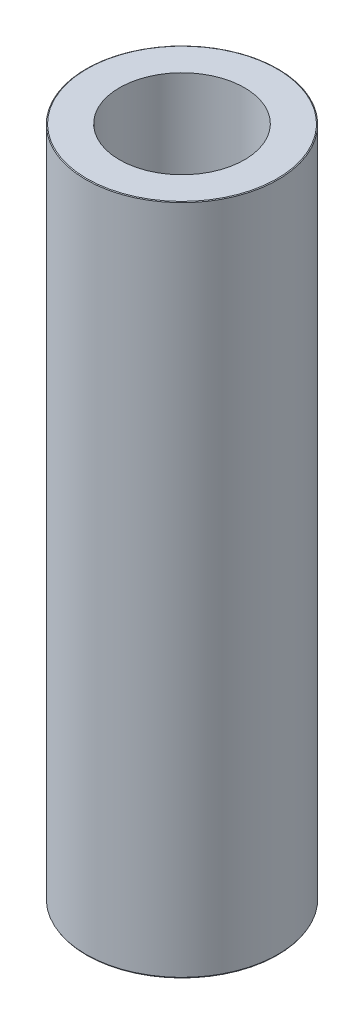
ISO-10303-21;
HEADER;
FILE_DESCRIPTION(('STEP AP214'),'2;1');
FILE_NAME('part.step','',(''),(''),'','','');
FILE_SCHEMA(('AUTOMOTIVE_DESIGN { 1 0 10303 214 1 1 1 1 }'));
ENDSEC;
DATA;
#1=APPLICATION_CONTEXT('core data for automotive mechanical design processes');
#2=APPLICATION_PROTOCOL_DEFINITION('international standard','automotive_design',2000,#1);
#3=PRODUCT_CONTEXT('',#1,'mechanical');
#4=PRODUCT('Part','Part','',(#3));
#5=PRODUCT_RELATED_PRODUCT_CATEGORY('part','',(#4));
#6=PRODUCT_DEFINITION_FORMATION('','',#4);
#7=PRODUCT_DEFINITION_CONTEXT('part definition',#1,'design');
#8=PRODUCT_DEFINITION('design','',#6,#7);
#9=PRODUCT_DEFINITION_SHAPE('','',#8);
#10=(LENGTH_UNIT() NAMED_UNIT(*) SI_UNIT(.MILLI.,.METRE.));
#11=(NAMED_UNIT(*) PLANE_ANGLE_UNIT() SI_UNIT($,.RADIAN.));
#12=(NAMED_UNIT(*) SI_UNIT($,.STERADIAN.) SOLID_ANGLE_UNIT());
#13=UNCERTAINTY_MEASURE_WITH_UNIT(LENGTH_MEASURE(1.E-05),#10,'distance_accuracy_value','');
#14=(GEOMETRIC_REPRESENTATION_CONTEXT(3) GLOBAL_UNCERTAINTY_ASSIGNED_CONTEXT((#13)) GLOBAL_UNIT_ASSIGNED_CONTEXT((#10,
#11,#12)) REPRESENTATION_CONTEXT('',''));
#15=CARTESIAN_POINT('',(0.,0.,0.));
#16=DIRECTION('',(0.,0.,1.));
#17=DIRECTION('',(1.,0.,0.));
#18=AXIS2_PLACEMENT_3D('',#15,#16,#17);
#19=CARTESIAN_POINT('',(0.,420.277864842251,0.));
#20=DIRECTION('',(0.,-1.,0.));
#21=DIRECTION('',(0.,0.,-1.));
#22=AXIS2_PLACEMENT_3D('',#19,#20,#21);
#23=CYLINDRICAL_SURFACE('',#22,60.);
#24=CARTESIAN_POINT('',(0.,419.965371538218,0.));
#25=DIRECTION('',(0.,1.,0.));
#26=DIRECTION('',(0.,0.,1.));
#27=AXIS2_PLACEMENT_3D('',#24,#25,#26);
#28=CIRCLE('',#27,60.);
#29=CARTESIAN_POINT('',(0.,419.965371538218,60.));
#30=VERTEX_POINT('',#29);
#31=EDGE_CURVE('E50',#30,#30,#28,.F.);
#32=ORIENTED_EDGE('',*,*,#31,.T.);
#33=EDGE_LOOP('',(#32));
#34=FACE_BOUND('',#33,.T.);
#35=CARTESIAN_POINT('',(0.,0.54125427960966,0.));
#36=DIRECTION('',(0.,1.,0.));
#37=DIRECTION('',(0.,0.,1.));
#38=AXIS2_PLACEMENT_3D('',#35,#36,#37);
#39=CIRCLE('',#38,60.);
#40=CARTESIAN_POINT('',(0.,0.54125427960966,60.));
#41=VERTEX_POINT('',#40);
#42=EDGE_CURVE('E51',#41,#41,#39,.T.);
#43=ORIENTED_EDGE('',*,*,#42,.T.);
#44=EDGE_LOOP('',(#43));
#45=FACE_BOUND('',#44,.T.);
#46=ADVANCED_FACE('F39',(#34,#45),#23,.T.);
#47=CARTESIAN_POINT('',(0.,420.277864842251,0.));
#48=DIRECTION('',(0.,1.,0.));
#49=DIRECTION('',(0.,0.,1.));
#50=AXIS2_PLACEMENT_3D('',#47,#48,#49);
#51=PLANE('',#50);
#52=CARTESIAN_POINT('',(0.,420.277864842251,0.));
#53=DIRECTION('',(0.,1.,0.));
#54=DIRECTION('',(0.,0.,1.));
#55=AXIS2_PLACEMENT_3D('',#52,#53,#54);
#56=CIRCLE('',#55,59.4587457203904);
#57=CARTESIAN_POINT('',(0.,420.277864842251,59.4587457203904));
#58=VERTEX_POINT('',#57);
#59=EDGE_CURVE('E54',#58,#58,#56,.T.);
#60=ORIENTED_EDGE('',*,*,#59,.T.);
#61=EDGE_LOOP('',(#60));
#62=FACE_BOUND('',#61,.T.);
#63=CARTESIAN_POINT('',(0.,420.277864842251,0.));
#64=DIRECTION('',(0.,1.,0.));
#65=DIRECTION('',(0.,0.,1.));
#66=AXIS2_PLACEMENT_3D('',#63,#64,#65);
#67=CIRCLE('',#66,39.0718315535893);
#68=CARTESIAN_POINT('',(0.,420.277864842251,39.0718315535893));
#69=VERTEX_POINT('',#68);
#70=EDGE_CURVE('E58',#69,#69,#67,.T.);
#71=ORIENTED_EDGE('',*,*,#70,.F.);
#72=EDGE_LOOP('',(#71));
#73=FACE_BOUND('',#72,.T.);
#74=ADVANCED_FACE('F69',(#62,#73),#51,.T.);
#75=CARTESIAN_POINT('',(0.,0.,0.));
#76=DIRECTION('',(0.,1.,0.));
#77=DIRECTION('',(0.,0.,1.));
#78=AXIS2_PLACEMENT_3D('',#75,#76,#77);
#79=PLANE('',#78);
#80=CARTESIAN_POINT('',(0.,0.,0.));
#81=DIRECTION('',(0.,1.,0.));
#82=DIRECTION('',(0.,0.,1.));
#83=AXIS2_PLACEMENT_3D('',#80,#81,#82);
#84=CIRCLE('',#83,59.6875066959673);
#85=CARTESIAN_POINT('',(0.,0.,59.6875066959673));
#86=VERTEX_POINT('',#85);
#87=EDGE_CURVE('E10',#86,#86,#84,.F.);
#88=ORIENTED_EDGE('',*,*,#87,.T.);
#89=EDGE_LOOP('',(#88));
#90=FACE_BOUND('',#89,.T.);
#91=CARTESIAN_POINT('',(0.,0.,0.));
#92=DIRECTION('',(0.,1.,0.));
#93=DIRECTION('',(0.,0.,1.));
#94=AXIS2_PLACEMENT_3D('',#91,#92,#93);
#95=CIRCLE('',#94,39.0718315535893);
#96=CARTESIAN_POINT('',(0.,0.,39.0718315535893));
#97=VERTEX_POINT('',#96);
#98=EDGE_CURVE('E63',#97,#97,#95,.T.);
#99=ORIENTED_EDGE('',*,*,#98,.T.);
#100=EDGE_LOOP('',(#99));
#101=FACE_BOUND('',#100,.T.);
#102=ADVANCED_FACE('F75',(#90,#101),#79,.F.);
#103=CARTESIAN_POINT('',(0.,420.277864842251,0.));
#104=DIRECTION('',(0.,-1.,0.));
#105=DIRECTION('',(0.,0.,-1.));
#106=AXIS2_PLACEMENT_3D('',#103,#104,#105);
#107=CYLINDRICAL_SURFACE('',#106,39.0718315535893);
#108=ORIENTED_EDGE('',*,*,#70,.T.);
#109=EDGE_LOOP('',(#108));
#110=FACE_BOUND('',#109,.T.);
#111=ORIENTED_EDGE('',*,*,#98,.F.);
#112=EDGE_LOOP('',(#111));
#113=FACE_BOUND('',#112,.T.);
#114=ADVANCED_FACE('F70',(#110,#113),#107,.F.);
#115=CARTESIAN_POINT('',(0.,420.277864842251,0.));
#116=DIRECTION('',(0.,-1.,0.));
#117=DIRECTION('',(0.,0.,-1.));
#118=AXIS2_PLACEMENT_3D('',#115,#116,#117);
#119=CONICAL_SURFACE('',#118,59.4587457203904,1.04719755119665);
#120=ORIENTED_EDGE('',*,*,#31,.F.);
#121=EDGE_LOOP('',(#120));
#122=FACE_BOUND('',#121,.T.);
#123=ORIENTED_EDGE('',*,*,#59,.F.);
#124=EDGE_LOOP('',(#123));
#125=FACE_BOUND('',#124,.T.);
#126=ADVANCED_FACE('F81',(#122,#125),#119,.T.);
#127=CARTESIAN_POINT('',(0.,0.54125427960966,0.));
#128=DIRECTION('',(0.,1.,0.));
#129=DIRECTION('',(0.,0.,1.));
#130=AXIS2_PLACEMENT_3D('',#127,#128,#129);
#131=CONICAL_SURFACE('',#130,60.,0.523598775598276);
#132=ORIENTED_EDGE('',*,*,#87,.F.);
#133=EDGE_LOOP('',(#132));
#134=FACE_BOUND('',#133,.T.);
#135=ORIENTED_EDGE('',*,*,#42,.F.);
#136=EDGE_LOOP('',(#135));
#137=FACE_BOUND('',#136,.T.);
#138=ADVANCED_FACE('F45',(#134,#137),#131,.T.);
#139=CLOSED_SHELL('',(#46,#74,#102,#114,#126,#138));
#140=MANIFOLD_SOLID_BREP('B2',#139);
#141=ADVANCED_BREP_SHAPE_REPRESENTATION('',(#18,#140),#14);
#142=SHAPE_DEFINITION_REPRESENTATION(#9,#141);
ENDSEC;
END-ISO-10303-21;
